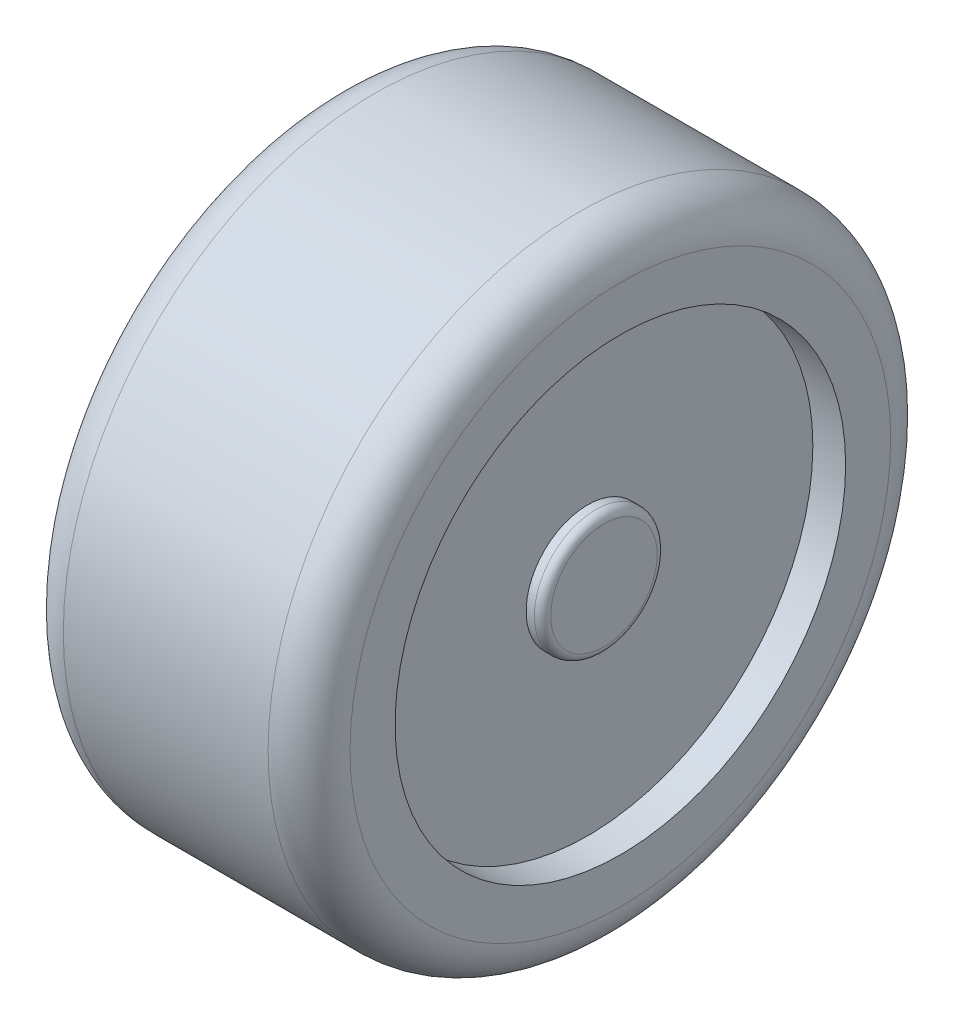
ISO-10303-21;
HEADER;
FILE_DESCRIPTION(('STEP AP214'),'2;1');
FILE_NAME('part.step','',(''),(''),'','','');
FILE_SCHEMA(('AUTOMOTIVE_DESIGN { 1 0 10303 214 1 1 1 1 }'));
ENDSEC;
DATA;
#1=APPLICATION_CONTEXT('core data for automotive mechanical design processes');
#2=APPLICATION_PROTOCOL_DEFINITION('international standard','automotive_design',2000,#1);
#3=PRODUCT_CONTEXT('',#1,'mechanical');
#4=PRODUCT('Part','Part','',(#3));
#5=PRODUCT_RELATED_PRODUCT_CATEGORY('part','',(#4));
#6=PRODUCT_DEFINITION_FORMATION('','',#4);
#7=PRODUCT_DEFINITION_CONTEXT('part definition',#1,'design');
#8=PRODUCT_DEFINITION('design','',#6,#7);
#9=PRODUCT_DEFINITION_SHAPE('','',#8);
#10=(LENGTH_UNIT() NAMED_UNIT(*) SI_UNIT(.MILLI.,.METRE.));
#11=(NAMED_UNIT(*) PLANE_ANGLE_UNIT() SI_UNIT($,.RADIAN.));
#12=(NAMED_UNIT(*) SI_UNIT($,.STERADIAN.) SOLID_ANGLE_UNIT());
#13=UNCERTAINTY_MEASURE_WITH_UNIT(LENGTH_MEASURE(1.E-05),#10,'distance_accuracy_value','');
#14=(GEOMETRIC_REPRESENTATION_CONTEXT(3) GLOBAL_UNCERTAINTY_ASSIGNED_CONTEXT((#13)) GLOBAL_UNIT_ASSIGNED_CONTEXT((#10,
#11,#12)) REPRESENTATION_CONTEXT('',''));
#15=CARTESIAN_POINT('',(0.,0.,0.));
#16=DIRECTION('',(0.,0.,1.));
#17=DIRECTION('',(1.,0.,0.));
#18=AXIS2_PLACEMENT_3D('',#15,#16,#17);
#19=CARTESIAN_POINT('',(5.,0.,0.));
#20=DIRECTION('',(-1.,0.,0.));
#21=DIRECTION('',(0.,0.,1.));
#22=AXIS2_PLACEMENT_3D('',#19,#20,#21);
#23=CYLINDRICAL_SURFACE('',#22,27.5);
#24=CARTESIAN_POINT('',(-30.,0.,0.));
#25=DIRECTION('',(1.,0.,0.));
#26=DIRECTION('',(0.,0.,-1.));
#27=AXIS2_PLACEMENT_3D('',#24,#25,#26);
#28=CIRCLE('',#27,27.5);
#29=CARTESIAN_POINT('',(-30.,0.,-27.5));
#30=VERTEX_POINT('',#29);
#31=EDGE_CURVE('E77',#30,#30,#28,.T.);
#32=ORIENTED_EDGE('',*,*,#31,.F.);
#33=EDGE_LOOP('',(#32));
#34=FACE_BOUND('',#33,.T.);
#35=CARTESIAN_POINT('',(-1.,0.,0.));
#36=DIRECTION('',(1.,0.,0.));
#37=DIRECTION('',(0.,0.,-1.));
#38=AXIS2_PLACEMENT_3D('',#35,#36,#37);
#39=CIRCLE('',#38,27.5);
#40=CARTESIAN_POINT('',(-1.,0.,-27.5));
#41=VERTEX_POINT('',#40);
#42=EDGE_CURVE('E81',#41,#41,#39,.T.);
#43=ORIENTED_EDGE('',*,*,#42,.T.);
#44=EDGE_LOOP('',(#43));
#45=FACE_BOUND('',#44,.T.);
#46=ADVANCED_FACE('F45',(#34,#45),#23,.F.);
#47=CARTESIAN_POINT('',(1.,0.,0.));
#48=DIRECTION('',(1.,0.,0.));
#49=DIRECTION('',(0.,0.,-1.));
#50=AXIS2_PLACEMENT_3D('',#47,#48,#49);
#51=CIRCLE('',#50,27.5);
#52=CARTESIAN_POINT('',(1.,0.,-27.5));
#53=VERTEX_POINT('',#52);
#54=EDGE_CURVE('E71',#53,#53,#51,.T.);
#55=ORIENTED_EDGE('',*,*,#54,.F.);
#56=EDGE_LOOP('',(#55));
#57=FACE_BOUND('',#56,.T.);
#58=CARTESIAN_POINT('',(5.,0.,0.));
#59=DIRECTION('',(1.,0.,0.));
#60=DIRECTION('',(0.,0.,-1.));
#61=AXIS2_PLACEMENT_3D('',#58,#59,#60);
#62=CIRCLE('',#61,27.5);
#63=CARTESIAN_POINT('',(5.,0.,-27.5));
#64=VERTEX_POINT('',#63);
#65=EDGE_CURVE('E74',#64,#64,#62,.T.);
#66=ORIENTED_EDGE('',*,*,#65,.T.);
#67=EDGE_LOOP('',(#66));
#68=FACE_BOUND('',#67,.T.);
#69=ADVANCED_FACE('F116',(#57,#68),#23,.F.);
#70=CARTESIAN_POINT('',(5.,0.,0.));
#71=DIRECTION('',(-1.,0.,0.));
#72=DIRECTION('',(0.,0.,1.));
#73=AXIS2_PLACEMENT_3D('',#70,#71,#72);
#74=CYLINDRICAL_SURFACE('',#73,38.);
#75=CARTESIAN_POINT('',(-25.,0.,0.));
#76=DIRECTION('',(1.,0.,0.));
#77=DIRECTION('',(0.,0.,-1.));
#78=AXIS2_PLACEMENT_3D('',#75,#76,#77);
#79=CIRCLE('',#78,38.);
#80=CARTESIAN_POINT('',(-25.,0.,-38.));
#81=VERTEX_POINT('',#80);
#82=EDGE_CURVE('E65',#81,#81,#79,.T.);
#83=ORIENTED_EDGE('',*,*,#82,.T.);
#84=EDGE_LOOP('',(#83));
#85=FACE_BOUND('',#84,.T.);
#86=CARTESIAN_POINT('',(0.,0.,0.));
#87=DIRECTION('',(1.,0.,0.));
#88=DIRECTION('',(0.,0.,-1.));
#89=AXIS2_PLACEMENT_3D('',#86,#87,#88);
#90=CIRCLE('',#89,38.);
#91=CARTESIAN_POINT('',(0.,0.,-38.));
#92=VERTEX_POINT('',#91);
#93=EDGE_CURVE('E68',#92,#92,#90,.F.);
#94=ORIENTED_EDGE('',*,*,#93,.T.);
#95=EDGE_LOOP('',(#94));
#96=FACE_BOUND('',#95,.T.);
#97=ADVANCED_FACE('F122',(#85,#96),#74,.T.);
#98=CARTESIAN_POINT('',(5.,0.,0.));
#99=DIRECTION('',(1.,0.,0.));
#100=DIRECTION('',(0.,0.,-1.));
#101=AXIS2_PLACEMENT_3D('',#98,#99,#100);
#102=PLANE('',#101);
#103=CARTESIAN_POINT('',(5.,0.,0.));
#104=DIRECTION('',(1.,0.,0.));
#105=DIRECTION('',(0.,0.,-1.));
#106=AXIS2_PLACEMENT_3D('',#103,#104,#105);
#107=CIRCLE('',#106,33.);
#108=CARTESIAN_POINT('',(5.,0.,-33.));
#109=VERTEX_POINT('',#108);
#110=EDGE_CURVE('E56',#109,#109,#107,.T.);
#111=ORIENTED_EDGE('',*,*,#110,.T.);
#112=EDGE_LOOP('',(#111));
#113=FACE_BOUND('',#112,.T.);
#114=ORIENTED_EDGE('',*,*,#65,.F.);
#115=EDGE_LOOP('',(#114));
#116=FACE_BOUND('',#115,.T.);
#117=ADVANCED_FACE('F144',(#113,#116),#102,.T.);
#118=CARTESIAN_POINT('',(-30.,0.,0.));
#119=DIRECTION('',(1.,0.,0.));
#120=DIRECTION('',(0.,0.,-1.));
#121=AXIS2_PLACEMENT_3D('',#118,#119,#120);
#122=PLANE('',#121);
#123=CARTESIAN_POINT('',(-30.,0.,0.));
#124=DIRECTION('',(1.,0.,0.));
#125=DIRECTION('',(0.,0.,-1.));
#126=AXIS2_PLACEMENT_3D('',#123,#124,#125);
#127=CIRCLE('',#126,33.);
#128=CARTESIAN_POINT('',(-30.,0.,-33.));
#129=VERTEX_POINT('',#128);
#130=EDGE_CURVE('E60',#129,#129,#127,.F.);
#131=ORIENTED_EDGE('',*,*,#130,.T.);
#132=EDGE_LOOP('',(#131));
#133=FACE_BOUND('',#132,.T.);
#134=ORIENTED_EDGE('',*,*,#31,.T.);
#135=EDGE_LOOP('',(#134));
#136=FACE_BOUND('',#135,.T.);
#137=ADVANCED_FACE('F147',(#133,#136),#122,.F.);
#138=CARTESIAN_POINT('',(1.,0.,0.));
#139=DIRECTION('',(1.,0.,0.));
#140=DIRECTION('',(0.,0.,-1.));
#141=AXIS2_PLACEMENT_3D('',#138,#139,#140);
#142=PLANE('',#141);
#143=CARTESIAN_POINT('',(1.,0.,0.));
#144=DIRECTION('',(1.,0.,0.));
#145=DIRECTION('',(0.,0.,-1.));
#146=AXIS2_PLACEMENT_3D('',#143,#144,#145);
#147=CIRCLE('',#146,7.5);
#148=CARTESIAN_POINT('',(1.,0.,-7.5));
#149=VERTEX_POINT('',#148);
#150=EDGE_CURVE('E80',#149,#149,#147,.T.);
#151=ORIENTED_EDGE('',*,*,#150,.F.);
#152=EDGE_LOOP('',(#151));
#153=FACE_BOUND('',#152,.T.);
#154=ORIENTED_EDGE('',*,*,#54,.T.);
#155=EDGE_LOOP('',(#154));
#156=FACE_BOUND('',#155,.T.);
#157=ADVANCED_FACE('F112',(#153,#156),#142,.T.);
#158=CARTESIAN_POINT('',(-1.,0.,0.));
#159=DIRECTION('',(1.,0.,0.));
#160=DIRECTION('',(0.,0.,-1.));
#161=AXIS2_PLACEMENT_3D('',#158,#159,#160);
#162=PLANE('',#161);
#163=CARTESIAN_POINT('',(-1.,0.,0.));
#164=DIRECTION('',(1.,0.,0.));
#165=DIRECTION('',(0.,0.,-1.));
#166=AXIS2_PLACEMENT_3D('',#163,#164,#165);
#167=CIRCLE('',#166,7.5);
#168=CARTESIAN_POINT('',(-1.,0.,-7.5));
#169=VERTEX_POINT('',#168);
#170=EDGE_CURVE('E84',#169,#169,#167,.F.);
#171=ORIENTED_EDGE('',*,*,#170,.F.);
#172=EDGE_LOOP('',(#171));
#173=FACE_BOUND('',#172,.T.);
#174=ORIENTED_EDGE('',*,*,#42,.F.);
#175=EDGE_LOOP('',(#174));
#176=FACE_BOUND('',#175,.T.);
#177=ADVANCED_FACE('F104',(#173,#176),#162,.F.);
#178=CARTESIAN_POINT('',(-50.,0.,0.));
#179=DIRECTION('',(1.,0.,0.));
#180=DIRECTION('',(0.,0.,-1.));
#181=AXIS2_PLACEMENT_3D('',#178,#179,#180);
#182=PLANE('',#181);
#183=CARTESIAN_POINT('',(-50.,0.,0.));
#184=DIRECTION('',(1.,0.,0.));
#185=DIRECTION('',(0.,0.,-1.));
#186=AXIS2_PLACEMENT_3D('',#183,#184,#185);
#187=CIRCLE('',#186,3.5);
#188=CARTESIAN_POINT('',(-50.,0.,-3.5));
#189=VERTEX_POINT('',#188);
#190=EDGE_CURVE('E93',#189,#189,#187,.T.);
#191=ORIENTED_EDGE('',*,*,#190,.F.);
#192=EDGE_LOOP('',(#191));
#193=FACE_BOUND('',#192,.T.);
#194=ADVANCED_FACE('F102',(#193),#182,.F.);
#195=CARTESIAN_POINT('',(-50.,0.,0.));
#196=DIRECTION('',(1.,0.,0.));
#197=DIRECTION('',(0.,0.,-1.));
#198=AXIS2_PLACEMENT_3D('',#195,#196,#197);
#199=CYLINDRICAL_SURFACE('',#198,3.5);
#200=ORIENTED_EDGE('',*,*,#190,.T.);
#201=EDGE_LOOP('',(#200));
#202=FACE_BOUND('',#201,.T.);
#203=CARTESIAN_POINT('',(-7.,0.,0.));
#204=DIRECTION('',(1.,0.,0.));
#205=DIRECTION('',(0.,0.,-1.));
#206=AXIS2_PLACEMENT_3D('',#203,#204,#205);
#207=CIRCLE('',#206,3.5);
#208=CARTESIAN_POINT('',(-7.,0.,-3.5));
#209=VERTEX_POINT('',#208);
#210=EDGE_CURVE('E90',#209,#209,#207,.T.);
#211=ORIENTED_EDGE('',*,*,#210,.F.);
#212=EDGE_LOOP('',(#211));
#213=FACE_BOUND('',#212,.T.);
#214=ADVANCED_FACE('F99',(#202,#213),#199,.T.);
#215=CARTESIAN_POINT('',(-7.,0.,0.));
#216=DIRECTION('',(1.,0.,0.));
#217=DIRECTION('',(0.,0.,-1.));
#218=AXIS2_PLACEMENT_3D('',#215,#216,#217);
#219=PLANE('',#218);
#220=ORIENTED_EDGE('',*,*,#210,.T.);
#221=EDGE_LOOP('',(#220));
#222=FACE_BOUND('',#221,.T.);
#223=CARTESIAN_POINT('',(-7.,0.,0.));
#224=DIRECTION('',(1.,0.,0.));
#225=DIRECTION('',(0.,0.,-1.));
#226=AXIS2_PLACEMENT_3D('',#223,#224,#225);
#227=CIRCLE('',#226,7.5);
#228=CARTESIAN_POINT('',(-7.,0.,-7.5));
#229=VERTEX_POINT('',#228);
#230=EDGE_CURVE('E89',#229,#229,#227,.T.);
#231=ORIENTED_EDGE('',*,*,#230,.F.);
#232=EDGE_LOOP('',(#231));
#233=FACE_BOUND('',#232,.T.);
#234=ADVANCED_FACE('F110',(#222,#233),#219,.F.);
#235=CARTESIAN_POINT('',(3.,0.,0.));
#236=DIRECTION('',(-1.,0.,0.));
#237=DIRECTION('',(0.,0.,1.));
#238=AXIS2_PLACEMENT_3D('',#235,#236,#237);
#239=CYLINDRICAL_SURFACE('',#238,7.5);
#240=ORIENTED_EDGE('',*,*,#230,.T.);
#241=EDGE_LOOP('',(#240));
#242=FACE_BOUND('',#241,.T.);
#243=ORIENTED_EDGE('',*,*,#170,.T.);
#244=EDGE_LOOP('',(#243));
#245=FACE_BOUND('',#244,.T.);
#246=ADVANCED_FACE('F164',(#242,#245),#239,.T.);
#247=CARTESIAN_POINT('',(2.,0.,0.));
#248=DIRECTION('',(1.,0.,0.));
#249=DIRECTION('',(0.,0.,-1.));
#250=AXIS2_PLACEMENT_3D('',#247,#248,#249);
#251=CIRCLE('',#250,7.5);
#252=CARTESIAN_POINT('',(2.,0.,-7.5));
#253=VERTEX_POINT('',#252);
#254=EDGE_CURVE('E11',#253,#253,#251,.F.);
#255=ORIENTED_EDGE('',*,*,#254,.T.);
#256=EDGE_LOOP('',(#255));
#257=FACE_BOUND('',#256,.T.);
#258=ORIENTED_EDGE('',*,*,#150,.T.);
#259=EDGE_LOOP('',(#258));
#260=FACE_BOUND('',#259,.T.);
#261=ADVANCED_FACE('F161',(#257,#260),#239,.T.);
#262=CARTESIAN_POINT('',(3.,0.,0.));
#263=DIRECTION('',(1.,0.,0.));
#264=DIRECTION('',(0.,0.,-1.));
#265=AXIS2_PLACEMENT_3D('',#262,#263,#264);
#266=PLANE('',#265);
#267=CARTESIAN_POINT('',(3.,0.,0.));
#268=DIRECTION('',(1.,0.,0.));
#269=DIRECTION('',(0.,0.,-1.));
#270=AXIS2_PLACEMENT_3D('',#267,#268,#269);
#271=CIRCLE('',#270,6.5);
#272=CARTESIAN_POINT('',(3.,0.,-6.5));
#273=VERTEX_POINT('',#272);
#274=EDGE_CURVE('E52',#273,#273,#271,.T.);
#275=ORIENTED_EDGE('',*,*,#274,.T.);
#276=EDGE_LOOP('',(#275));
#277=FACE_BOUND('',#276,.T.);
#278=ADVANCED_FACE('F132',(#277),#266,.T.);
#279=CARTESIAN_POINT('',(-25.,0.,0.));
#280=DIRECTION('',(1.,0.,0.));
#281=DIRECTION('',(0.,0.,-1.));
#282=AXIS2_PLACEMENT_3D('',#279,#280,#281);
#283=TOROIDAL_SURFACE('',#282,33.,5.);
#284=ORIENTED_EDGE('',*,*,#130,.F.);
#285=EDGE_LOOP('',(#284));
#286=FACE_BOUND('',#285,.T.);
#287=ORIENTED_EDGE('',*,*,#82,.F.);
#288=EDGE_LOOP('',(#287));
#289=FACE_BOUND('',#288,.T.);
#290=ADVANCED_FACE('F129',(#286,#289),#283,.T.);
#291=CARTESIAN_POINT('',(0.,0.,0.));
#292=DIRECTION('',(1.,0.,0.));
#293=DIRECTION('',(0.,0.,-1.));
#294=AXIS2_PLACEMENT_3D('',#291,#292,#293);
#295=TOROIDAL_SURFACE('',#294,33.,5.);
#296=ORIENTED_EDGE('',*,*,#93,.F.);
#297=EDGE_LOOP('',(#296));
#298=FACE_BOUND('',#297,.T.);
#299=ORIENTED_EDGE('',*,*,#110,.F.);
#300=EDGE_LOOP('',(#299));
#301=FACE_BOUND('',#300,.T.);
#302=ADVANCED_FACE('F131',(#298,#301),#295,.T.);
#303=CARTESIAN_POINT('',(2.,0.,0.));
#304=DIRECTION('',(1.,0.,0.));
#305=DIRECTION('',(0.,0.,-1.));
#306=AXIS2_PLACEMENT_3D('',#303,#304,#305);
#307=TOROIDAL_SURFACE('',#306,6.5,1.);
#308=ORIENTED_EDGE('',*,*,#254,.F.);
#309=EDGE_LOOP('',(#308));
#310=FACE_BOUND('',#309,.T.);
#311=ORIENTED_EDGE('',*,*,#274,.F.);
#312=EDGE_LOOP('',(#311));
#313=FACE_BOUND('',#312,.T.);
#314=ADVANCED_FACE('F47',(#310,#313),#307,.T.);
#315=CLOSED_SHELL('',(#46,#69,#97,#117,#137,#157,#177,#194,#214,#234,#246,#261,#278,#290,#302,#314));
#316=MANIFOLD_SOLID_BREP('B2',#315);
#317=ADVANCED_BREP_SHAPE_REPRESENTATION('',(#18,#316),#14);
#318=SHAPE_DEFINITION_REPRESENTATION(#9,#317);
ENDSEC;
END-ISO-10303-21;
